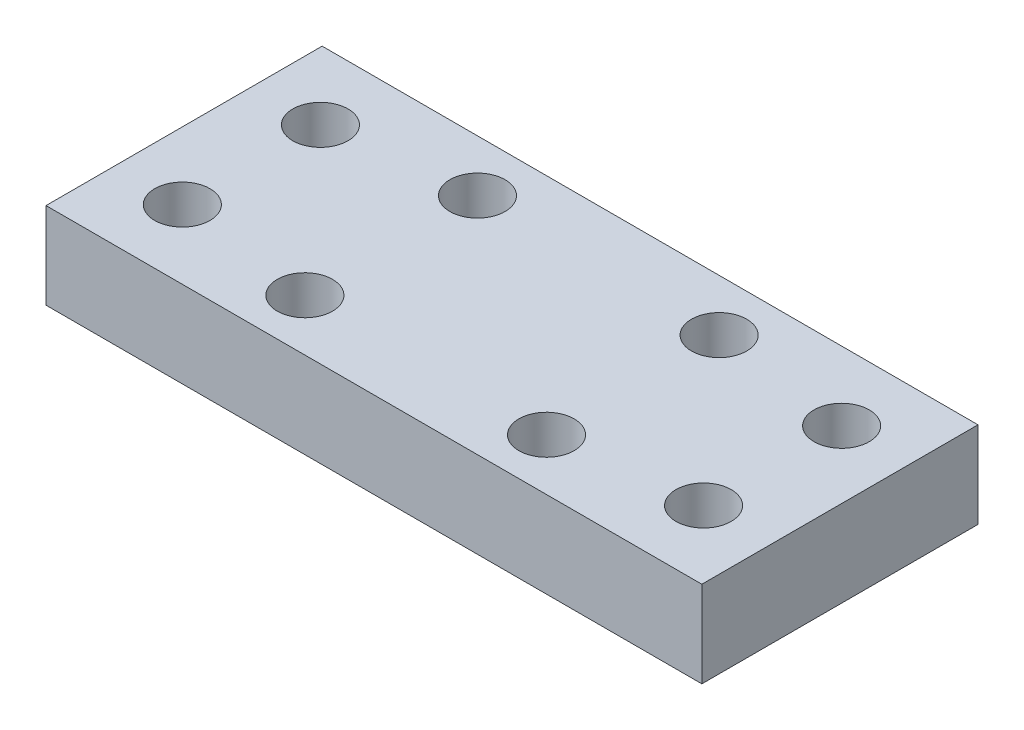
ISO-10303-21;
HEADER;
FILE_DESCRIPTION(('STEP AP214'),'2;1');
FILE_NAME('part.step','',(''),(''),'','','');
FILE_SCHEMA(('AUTOMOTIVE_DESIGN { 1 0 10303 214 1 1 1 1 }'));
ENDSEC;
DATA;
#1=APPLICATION_CONTEXT('core data for automotive mechanical design processes');
#2=APPLICATION_PROTOCOL_DEFINITION('international standard','automotive_design',2000,#1);
#3=PRODUCT_CONTEXT('',#1,'mechanical');
#4=PRODUCT('Part','Part','',(#3));
#5=PRODUCT_RELATED_PRODUCT_CATEGORY('part','',(#4));
#6=PRODUCT_DEFINITION_FORMATION('','',#4);
#7=PRODUCT_DEFINITION_CONTEXT('part definition',#1,'design');
#8=PRODUCT_DEFINITION('design','',#6,#7);
#9=PRODUCT_DEFINITION_SHAPE('','',#8);
#10=(LENGTH_UNIT() NAMED_UNIT(*) SI_UNIT(.MILLI.,.METRE.));
#11=(NAMED_UNIT(*) PLANE_ANGLE_UNIT() SI_UNIT($,.RADIAN.));
#12=(NAMED_UNIT(*) SI_UNIT($,.STERADIAN.) SOLID_ANGLE_UNIT());
#13=UNCERTAINTY_MEASURE_WITH_UNIT(LENGTH_MEASURE(1.E-05),#10,'distance_accuracy_value','');
#14=(GEOMETRIC_REPRESENTATION_CONTEXT(3) GLOBAL_UNCERTAINTY_ASSIGNED_CONTEXT((#13)) GLOBAL_UNIT_ASSIGNED_CONTEXT((#10,
#11,#12)) REPRESENTATION_CONTEXT('',''));
#15=CARTESIAN_POINT('',(0.,0.,0.));
#16=DIRECTION('',(0.,0.,1.));
#17=DIRECTION('',(1.,0.,0.));
#18=AXIS2_PLACEMENT_3D('',#15,#16,#17);
#19=CARTESIAN_POINT('',(0.,5.,0.));
#20=DIRECTION('',(0.,1.,0.));
#21=DIRECTION('',(0.,0.,1.));
#22=AXIS2_PLACEMENT_3D('',#19,#20,#21);
#23=PLANE('',#22);
#24=CARTESIAN_POINT('',(6.99999999999997,5.,9.));
#25=DIRECTION('',(0.,1.,0.));
#26=DIRECTION('',(0.,0.,-1.));
#27=AXIS2_PLACEMENT_3D('',#24,#25,#26);
#28=CIRCLE('',#27,1.6);
#29=CARTESIAN_POINT('',(6.99999999999997,5.,7.4));
#30=VERTEX_POINT('',#29);
#31=EDGE_CURVE('E149',#30,#30,#28,.T.);
#32=ORIENTED_EDGE('',*,*,#31,.F.);
#33=EDGE_LOOP('',(#32));
#34=FACE_BOUND('',#33,.T.);
#35=CARTESIAN_POINT('',(-15.1,5.,8.));
#36=DIRECTION('',(0.,1.,0.));
#37=DIRECTION('',(0.,0.,-1.));
#38=AXIS2_PLACEMENT_3D('',#35,#36,#37);
#39=CIRCLE('',#38,1.6);
#40=CARTESIAN_POINT('',(-15.1,5.,6.4));
#41=VERTEX_POINT('',#40);
#42=EDGE_CURVE('E157',#41,#41,#39,.T.);
#43=ORIENTED_EDGE('',*,*,#42,.F.);
#44=EDGE_LOOP('',(#43));
#45=FACE_BOUND('',#44,.T.);
#46=CARTESIAN_POINT('',(15.1,5.,0.));
#47=DIRECTION('',(0.,1.,0.));
#48=DIRECTION('',(0.,0.,1.));
#49=AXIS2_PLACEMENT_3D('',#46,#47,#48);
#50=CIRCLE('',#49,1.6);
#51=CARTESIAN_POINT('',(15.1,5.,1.6));
#52=VERTEX_POINT('',#51);
#53=EDGE_CURVE('E165',#52,#52,#50,.T.);
#54=ORIENTED_EDGE('',*,*,#53,.F.);
#55=EDGE_LOOP('',(#54));
#56=FACE_BOUND('',#55,.T.);
#57=CARTESIAN_POINT('',(-7.,5.,-1.));
#58=DIRECTION('',(0.,1.,0.));
#59=DIRECTION('',(0.,0.,1.));
#60=AXIS2_PLACEMENT_3D('',#57,#58,#59);
#61=CIRCLE('',#60,1.6);
#62=CARTESIAN_POINT('',(-7.,5.,0.600000000000002));
#63=VERTEX_POINT('',#62);
#64=EDGE_CURVE('E99',#63,#63,#61,.T.);
#65=ORIENTED_EDGE('',*,*,#64,.F.);
#66=EDGE_LOOP('',(#65));
#67=FACE_BOUND('',#66,.T.);
#68=DIRECTION('',(0.,0.,1.));
#69=VECTOR('',#68,1.);
#70=CARTESIAN_POINT('',(-19.,5.,-4.));
#71=LINE('',#70,#69);
#72=CARTESIAN_POINT('',(-19.,5.,-4.));
#73=VERTEX_POINT('',#72);
#74=CARTESIAN_POINT('',(-19.,5.,12.));
#75=VERTEX_POINT('',#74);
#76=EDGE_CURVE('E79',#73,#75,#71,.T.);
#77=ORIENTED_EDGE('',*,*,#76,.T.);
#78=DIRECTION('',(1.,0.,0.));
#79=VECTOR('',#78,1.);
#80=CARTESIAN_POINT('',(-19.,5.,12.));
#81=LINE('',#80,#79);
#82=CARTESIAN_POINT('',(19.,5.,12.));
#83=VERTEX_POINT('',#82);
#84=EDGE_CURVE('E82',#75,#83,#81,.T.);
#85=ORIENTED_EDGE('',*,*,#84,.T.);
#86=DIRECTION('',(0.,0.,-1.));
#87=VECTOR('',#86,1.);
#88=CARTESIAN_POINT('',(19.,5.,-4.));
#89=LINE('',#88,#87);
#90=CARTESIAN_POINT('',(19.,5.,-4.));
#91=VERTEX_POINT('',#90);
#92=EDGE_CURVE('E86',#83,#91,#89,.T.);
#93=ORIENTED_EDGE('',*,*,#92,.T.);
#94=DIRECTION('',(-1.,0.,0.));
#95=VECTOR('',#94,1.);
#96=CARTESIAN_POINT('',(-19.,5.,-4.));
#97=LINE('',#96,#95);
#98=EDGE_CURVE('E50',#91,#73,#97,.T.);
#99=ORIENTED_EDGE('',*,*,#98,.T.);
#100=EDGE_LOOP('',(#77,#85,#93,#99));
#101=FACE_BOUND('',#100,.T.);
#102=CARTESIAN_POINT('',(7.,5.,-1.));
#103=DIRECTION('',(0.,1.,0.));
#104=DIRECTION('',(0.,0.,1.));
#105=AXIS2_PLACEMENT_3D('',#102,#103,#104);
#106=CIRCLE('',#105,1.6);
#107=CARTESIAN_POINT('',(7.,5.,0.600000000000002));
#108=VERTEX_POINT('',#107);
#109=EDGE_CURVE('E169',#108,#108,#106,.T.);
#110=ORIENTED_EDGE('',*,*,#109,.F.);
#111=EDGE_LOOP('',(#110));
#112=FACE_BOUND('',#111,.T.);
#113=CARTESIAN_POINT('',(-15.1,5.,0.));
#114=DIRECTION('',(0.,1.,0.));
#115=DIRECTION('',(0.,0.,1.));
#116=AXIS2_PLACEMENT_3D('',#113,#114,#115);
#117=CIRCLE('',#116,1.6);
#118=CARTESIAN_POINT('',(-15.1,5.,1.6));
#119=VERTEX_POINT('',#118);
#120=EDGE_CURVE('E161',#119,#119,#117,.T.);
#121=ORIENTED_EDGE('',*,*,#120,.F.);
#122=EDGE_LOOP('',(#121));
#123=FACE_BOUND('',#122,.T.);
#124=CARTESIAN_POINT('',(15.1,5.,8.));
#125=DIRECTION('',(0.,1.,0.));
#126=DIRECTION('',(0.,0.,-1.));
#127=AXIS2_PLACEMENT_3D('',#124,#125,#126);
#128=CIRCLE('',#127,1.6);
#129=CARTESIAN_POINT('',(15.1,5.,6.4));
#130=VERTEX_POINT('',#129);
#131=EDGE_CURVE('E153',#130,#130,#128,.T.);
#132=ORIENTED_EDGE('',*,*,#131,.F.);
#133=EDGE_LOOP('',(#132));
#134=FACE_BOUND('',#133,.T.);
#135=CARTESIAN_POINT('',(-7.00000000000002,5.,9.));
#136=DIRECTION('',(0.,1.,0.));
#137=DIRECTION('',(0.,0.,-1.));
#138=AXIS2_PLACEMENT_3D('',#135,#136,#137);
#139=CIRCLE('',#138,1.6);
#140=CARTESIAN_POINT('',(-7.00000000000002,5.,7.4));
#141=VERTEX_POINT('',#140);
#142=EDGE_CURVE('E144',#141,#141,#139,.T.);
#143=ORIENTED_EDGE('',*,*,#142,.F.);
#144=EDGE_LOOP('',(#143));
#145=FACE_BOUND('',#144,.T.);
#146=ADVANCED_FACE('F33',(#34,#45,#56,#67,#101,#112,#123,#134,#145),#23,.T.);
#147=CARTESIAN_POINT('',(0.,0.,0.));
#148=DIRECTION('',(0.,1.,0.));
#149=DIRECTION('',(0.,0.,1.));
#150=AXIS2_PLACEMENT_3D('',#147,#148,#149);
#151=PLANE('',#150);
#152=DIRECTION('',(0.,0.,1.));
#153=VECTOR('',#152,1.);
#154=CARTESIAN_POINT('',(-19.,0.,12.));
#155=LINE('',#154,#153);
#156=CARTESIAN_POINT('',(-19.,0.,-4.));
#157=VERTEX_POINT('',#156);
#158=CARTESIAN_POINT('',(-19.,0.,12.));
#159=VERTEX_POINT('',#158);
#160=EDGE_CURVE('E74',#157,#159,#155,.T.);
#161=ORIENTED_EDGE('',*,*,#160,.F.);
#162=DIRECTION('',(-1.,0.,0.));
#163=VECTOR('',#162,1.);
#164=CARTESIAN_POINT('',(-19.,0.,-4.));
#165=LINE('',#164,#163);
#166=CARTESIAN_POINT('',(19.,0.,-4.));
#167=VERTEX_POINT('',#166);
#168=EDGE_CURVE('E102',#167,#157,#165,.T.);
#169=ORIENTED_EDGE('',*,*,#168,.F.);
#170=DIRECTION('',(0.,0.,-1.));
#171=VECTOR('',#170,1.);
#172=CARTESIAN_POINT('',(19.,0.,-4.));
#173=LINE('',#172,#171);
#174=CARTESIAN_POINT('',(19.,0.,12.));
#175=VERTEX_POINT('',#174);
#176=EDGE_CURVE('E67',#175,#167,#173,.T.);
#177=ORIENTED_EDGE('',*,*,#176,.F.);
#178=DIRECTION('',(1.,0.,0.));
#179=VECTOR('',#178,1.);
#180=CARTESIAN_POINT('',(-19.,0.,12.));
#181=LINE('',#180,#179);
#182=EDGE_CURVE('E90',#159,#175,#181,.T.);
#183=ORIENTED_EDGE('',*,*,#182,.F.);
#184=EDGE_LOOP('',(#161,#169,#177,#183));
#185=FACE_BOUND('',#184,.T.);
#186=CARTESIAN_POINT('',(-7.,0.,-1.));
#187=DIRECTION('',(0.,1.,0.));
#188=DIRECTION('',(0.,0.,1.));
#189=AXIS2_PLACEMENT_3D('',#186,#187,#188);
#190=CIRCLE('',#189,1.6);
#191=CARTESIAN_POINT('',(-7.,0.,0.600000000000002));
#192=VERTEX_POINT('',#191);
#193=EDGE_CURVE('E115',#192,#192,#190,.T.);
#194=ORIENTED_EDGE('',*,*,#193,.T.);
#195=EDGE_LOOP('',(#194));
#196=FACE_BOUND('',#195,.T.);
#197=CARTESIAN_POINT('',(7.,0.,-1.));
#198=DIRECTION('',(0.,1.,0.));
#199=DIRECTION('',(0.,0.,1.));
#200=AXIS2_PLACEMENT_3D('',#197,#198,#199);
#201=CIRCLE('',#200,1.6);
#202=CARTESIAN_POINT('',(7.,0.,0.600000000000002));
#203=VERTEX_POINT('',#202);
#204=EDGE_CURVE('E119',#203,#203,#201,.T.);
#205=ORIENTED_EDGE('',*,*,#204,.T.);
#206=EDGE_LOOP('',(#205));
#207=FACE_BOUND('',#206,.T.);
#208=CARTESIAN_POINT('',(15.1,0.,0.));
#209=DIRECTION('',(0.,1.,0.));
#210=DIRECTION('',(0.,0.,1.));
#211=AXIS2_PLACEMENT_3D('',#208,#209,#210);
#212=CIRCLE('',#211,1.6);
#213=CARTESIAN_POINT('',(15.1,0.,1.6));
#214=VERTEX_POINT('',#213);
#215=EDGE_CURVE('E123',#214,#214,#212,.T.);
#216=ORIENTED_EDGE('',*,*,#215,.T.);
#217=EDGE_LOOP('',(#216));
#218=FACE_BOUND('',#217,.T.);
#219=CARTESIAN_POINT('',(-15.1,0.,0.));
#220=DIRECTION('',(0.,1.,0.));
#221=DIRECTION('',(0.,0.,1.));
#222=AXIS2_PLACEMENT_3D('',#219,#220,#221);
#223=CIRCLE('',#222,1.6);
#224=CARTESIAN_POINT('',(-15.1,0.,1.6));
#225=VERTEX_POINT('',#224);
#226=EDGE_CURVE('E127',#225,#225,#223,.T.);
#227=ORIENTED_EDGE('',*,*,#226,.T.);
#228=EDGE_LOOP('',(#227));
#229=FACE_BOUND('',#228,.T.);
#230=CARTESIAN_POINT('',(-15.1,0.,8.));
#231=DIRECTION('',(0.,1.,0.));
#232=DIRECTION('',(0.,0.,-1.));
#233=AXIS2_PLACEMENT_3D('',#230,#231,#232);
#234=CIRCLE('',#233,1.6);
#235=CARTESIAN_POINT('',(-15.1,0.,6.4));
#236=VERTEX_POINT('',#235);
#237=EDGE_CURVE('E131',#236,#236,#234,.T.);
#238=ORIENTED_EDGE('',*,*,#237,.T.);
#239=EDGE_LOOP('',(#238));
#240=FACE_BOUND('',#239,.T.);
#241=CARTESIAN_POINT('',(15.1,0.,8.));
#242=DIRECTION('',(0.,1.,0.));
#243=DIRECTION('',(0.,0.,-1.));
#244=AXIS2_PLACEMENT_3D('',#241,#242,#243);
#245=CIRCLE('',#244,1.6);
#246=CARTESIAN_POINT('',(15.1,0.,6.4));
#247=VERTEX_POINT('',#246);
#248=EDGE_CURVE('E135',#247,#247,#245,.T.);
#249=ORIENTED_EDGE('',*,*,#248,.T.);
#250=EDGE_LOOP('',(#249));
#251=FACE_BOUND('',#250,.T.);
#252=CARTESIAN_POINT('',(6.99999999999997,0.,9.));
#253=DIRECTION('',(0.,1.,0.));
#254=DIRECTION('',(0.,0.,-1.));
#255=AXIS2_PLACEMENT_3D('',#252,#253,#254);
#256=CIRCLE('',#255,1.6);
#257=CARTESIAN_POINT('',(6.99999999999997,0.,7.4));
#258=VERTEX_POINT('',#257);
#259=EDGE_CURVE('E139',#258,#258,#256,.T.);
#260=ORIENTED_EDGE('',*,*,#259,.T.);
#261=EDGE_LOOP('',(#260));
#262=FACE_BOUND('',#261,.T.);
#263=CARTESIAN_POINT('',(-7.00000000000002,0.,9.));
#264=DIRECTION('',(0.,1.,0.));
#265=DIRECTION('',(0.,0.,-1.));
#266=AXIS2_PLACEMENT_3D('',#263,#264,#265);
#267=CIRCLE('',#266,1.6);
#268=CARTESIAN_POINT('',(-7.00000000000002,0.,7.4));
#269=VERTEX_POINT('',#268);
#270=EDGE_CURVE('E142',#269,#269,#267,.T.);
#271=ORIENTED_EDGE('',*,*,#270,.T.);
#272=EDGE_LOOP('',(#271));
#273=FACE_BOUND('',#272,.T.);
#274=ADVANCED_FACE('F108',(#185,#196,#207,#218,#229,#240,#251,#262,#273),#151,.F.);
#275=CARTESIAN_POINT('',(-19.,5.,12.));
#276=DIRECTION('',(1.,0.,0.));
#277=DIRECTION('',(0.,0.,-1.));
#278=AXIS2_PLACEMENT_3D('',#275,#276,#277);
#279=PLANE('',#278);
#280=ORIENTED_EDGE('',*,*,#160,.T.);
#281=DIRECTION('',(0.,-1.,0.));
#282=VECTOR('',#281,1.);
#283=CARTESIAN_POINT('',(-19.,5.,12.));
#284=LINE('',#283,#282);
#285=EDGE_CURVE('E11',#75,#159,#284,.T.);
#286=ORIENTED_EDGE('',*,*,#285,.F.);
#287=ORIENTED_EDGE('',*,*,#76,.F.);
#288=DIRECTION('',(0.,-1.,0.));
#289=VECTOR('',#288,1.);
#290=CARTESIAN_POINT('',(-19.,5.,-4.));
#291=LINE('',#290,#289);
#292=EDGE_CURVE('E94',#73,#157,#291,.T.);
#293=ORIENTED_EDGE('',*,*,#292,.T.);
#294=EDGE_LOOP('',(#280,#286,#287,#293));
#295=FACE_BOUND('',#294,.T.);
#296=ADVANCED_FACE('F35',(#295),#279,.F.);
#297=CARTESIAN_POINT('',(-19.,5.,12.));
#298=DIRECTION('',(0.,0.,-1.));
#299=DIRECTION('',(-1.,0.,0.));
#300=AXIS2_PLACEMENT_3D('',#297,#298,#299);
#301=PLANE('',#300);
#302=ORIENTED_EDGE('',*,*,#182,.T.);
#303=DIRECTION('',(0.,-1.,0.));
#304=VECTOR('',#303,1.);
#305=CARTESIAN_POINT('',(19.,5.,12.));
#306=LINE('',#305,#304);
#307=EDGE_CURVE('E42',#83,#175,#306,.T.);
#308=ORIENTED_EDGE('',*,*,#307,.F.);
#309=ORIENTED_EDGE('',*,*,#84,.F.);
#310=ORIENTED_EDGE('',*,*,#285,.T.);
#311=EDGE_LOOP('',(#302,#308,#309,#310));
#312=FACE_BOUND('',#311,.T.);
#313=ADVANCED_FACE('F89',(#312),#301,.F.);
#314=CARTESIAN_POINT('',(19.,5.,-4.));
#315=DIRECTION('',(-1.,0.,0.));
#316=DIRECTION('',(0.,0.,1.));
#317=AXIS2_PLACEMENT_3D('',#314,#315,#316);
#318=PLANE('',#317);
#319=ORIENTED_EDGE('',*,*,#176,.T.);
#320=DIRECTION('',(0.,-1.,0.));
#321=VECTOR('',#320,1.);
#322=CARTESIAN_POINT('',(19.,5.,-4.));
#323=LINE('',#322,#321);
#324=EDGE_CURVE('E91',#91,#167,#323,.T.);
#325=ORIENTED_EDGE('',*,*,#324,.F.);
#326=ORIENTED_EDGE('',*,*,#92,.F.);
#327=ORIENTED_EDGE('',*,*,#307,.T.);
#328=EDGE_LOOP('',(#319,#325,#326,#327));
#329=FACE_BOUND('',#328,.T.);
#330=ADVANCED_FACE('F92',(#329),#318,.F.);
#331=CARTESIAN_POINT('',(-19.,5.,-4.));
#332=DIRECTION('',(0.,0.,1.));
#333=DIRECTION('',(1.,0.,0.));
#334=AXIS2_PLACEMENT_3D('',#331,#332,#333);
#335=PLANE('',#334);
#336=ORIENTED_EDGE('',*,*,#168,.T.);
#337=ORIENTED_EDGE('',*,*,#292,.F.);
#338=ORIENTED_EDGE('',*,*,#98,.F.);
#339=ORIENTED_EDGE('',*,*,#324,.T.);
#340=EDGE_LOOP('',(#336,#337,#338,#339));
#341=FACE_BOUND('',#340,.T.);
#342=ADVANCED_FACE('F107',(#341),#335,.F.);
#343=CARTESIAN_POINT('',(-7.,5.,-1.));
#344=DIRECTION('',(0.,-1.,0.));
#345=DIRECTION('',(0.,0.,-1.));
#346=AXIS2_PLACEMENT_3D('',#343,#344,#345);
#347=CYLINDRICAL_SURFACE('',#346,1.6);
#348=ORIENTED_EDGE('',*,*,#64,.T.);
#349=EDGE_LOOP('',(#348));
#350=FACE_BOUND('',#349,.T.);
#351=ORIENTED_EDGE('',*,*,#193,.F.);
#352=EDGE_LOOP('',(#351));
#353=FACE_BOUND('',#352,.T.);
#354=ADVANCED_FACE('F177',(#350,#353),#347,.F.);
#355=CARTESIAN_POINT('',(7.,5.,-1.));
#356=DIRECTION('',(0.,-1.,0.));
#357=DIRECTION('',(0.,0.,-1.));
#358=AXIS2_PLACEMENT_3D('',#355,#356,#357);
#359=CYLINDRICAL_SURFACE('',#358,1.6);
#360=ORIENTED_EDGE('',*,*,#109,.T.);
#361=EDGE_LOOP('',(#360));
#362=FACE_BOUND('',#361,.T.);
#363=ORIENTED_EDGE('',*,*,#204,.F.);
#364=EDGE_LOOP('',(#363));
#365=FACE_BOUND('',#364,.T.);
#366=ADVANCED_FACE('F237',(#362,#365),#359,.F.);
#367=CARTESIAN_POINT('',(15.1,5.,0.));
#368=DIRECTION('',(0.,-1.,0.));
#369=DIRECTION('',(0.,0.,-1.));
#370=AXIS2_PLACEMENT_3D('',#367,#368,#369);
#371=CYLINDRICAL_SURFACE('',#370,1.6);
#372=ORIENTED_EDGE('',*,*,#53,.T.);
#373=EDGE_LOOP('',(#372));
#374=FACE_BOUND('',#373,.T.);
#375=ORIENTED_EDGE('',*,*,#215,.F.);
#376=EDGE_LOOP('',(#375));
#377=FACE_BOUND('',#376,.T.);
#378=ADVANCED_FACE('F244',(#374,#377),#371,.F.);
#379=CARTESIAN_POINT('',(-15.1,5.,0.));
#380=DIRECTION('',(0.,-1.,0.));
#381=DIRECTION('',(0.,0.,-1.));
#382=AXIS2_PLACEMENT_3D('',#379,#380,#381);
#383=CYLINDRICAL_SURFACE('',#382,1.6);
#384=ORIENTED_EDGE('',*,*,#120,.T.);
#385=EDGE_LOOP('',(#384));
#386=FACE_BOUND('',#385,.T.);
#387=ORIENTED_EDGE('',*,*,#226,.F.);
#388=EDGE_LOOP('',(#387));
#389=FACE_BOUND('',#388,.T.);
#390=ADVANCED_FACE('F252',(#386,#389),#383,.F.);
#391=CARTESIAN_POINT('',(-15.1,5.,8.));
#392=DIRECTION('',(0.,-1.,0.));
#393=DIRECTION('',(0.,0.,-1.));
#394=AXIS2_PLACEMENT_3D('',#391,#392,#393);
#395=CYLINDRICAL_SURFACE('',#394,1.6);
#396=ORIENTED_EDGE('',*,*,#42,.T.);
#397=EDGE_LOOP('',(#396));
#398=FACE_BOUND('',#397,.T.);
#399=ORIENTED_EDGE('',*,*,#237,.F.);
#400=EDGE_LOOP('',(#399));
#401=FACE_BOUND('',#400,.T.);
#402=ADVANCED_FACE('F261',(#398,#401),#395,.F.);
#403=CARTESIAN_POINT('',(15.1,5.,8.));
#404=DIRECTION('',(0.,-1.,0.));
#405=DIRECTION('',(0.,0.,-1.));
#406=AXIS2_PLACEMENT_3D('',#403,#404,#405);
#407=CYLINDRICAL_SURFACE('',#406,1.6);
#408=ORIENTED_EDGE('',*,*,#131,.T.);
#409=EDGE_LOOP('',(#408));
#410=FACE_BOUND('',#409,.T.);
#411=ORIENTED_EDGE('',*,*,#248,.F.);
#412=EDGE_LOOP('',(#411));
#413=FACE_BOUND('',#412,.T.);
#414=ADVANCED_FACE('F270',(#410,#413),#407,.F.);
#415=CARTESIAN_POINT('',(6.99999999999997,5.,9.));
#416=DIRECTION('',(0.,-1.,0.));
#417=DIRECTION('',(0.,0.,-1.));
#418=AXIS2_PLACEMENT_3D('',#415,#416,#417);
#419=CYLINDRICAL_SURFACE('',#418,1.6);
#420=ORIENTED_EDGE('',*,*,#31,.T.);
#421=EDGE_LOOP('',(#420));
#422=FACE_BOUND('',#421,.T.);
#423=ORIENTED_EDGE('',*,*,#259,.F.);
#424=EDGE_LOOP('',(#423));
#425=FACE_BOUND('',#424,.T.);
#426=ADVANCED_FACE('F279',(#422,#425),#419,.F.);
#427=CARTESIAN_POINT('',(-7.00000000000002,5.,9.));
#428=DIRECTION('',(0.,-1.,0.));
#429=DIRECTION('',(0.,0.,-1.));
#430=AXIS2_PLACEMENT_3D('',#427,#428,#429);
#431=CYLINDRICAL_SURFACE('',#430,1.6);
#432=ORIENTED_EDGE('',*,*,#142,.T.);
#433=EDGE_LOOP('',(#432));
#434=FACE_BOUND('',#433,.T.);
#435=ORIENTED_EDGE('',*,*,#270,.F.);
#436=EDGE_LOOP('',(#435));
#437=FACE_BOUND('',#436,.T.);
#438=ADVANCED_FACE('F288',(#434,#437),#431,.F.);
#439=CLOSED_SHELL('',(#146,#274,#296,#313,#330,#342,#354,#366,#378,#390,#402,#414,#426,#438));
#440=MANIFOLD_SOLID_BREP('B2',#439);
#441=ADVANCED_BREP_SHAPE_REPRESENTATION('',(#18,#440),#14);
#442=SHAPE_DEFINITION_REPRESENTATION(#9,#441);
ENDSEC;
END-ISO-10303-21;
